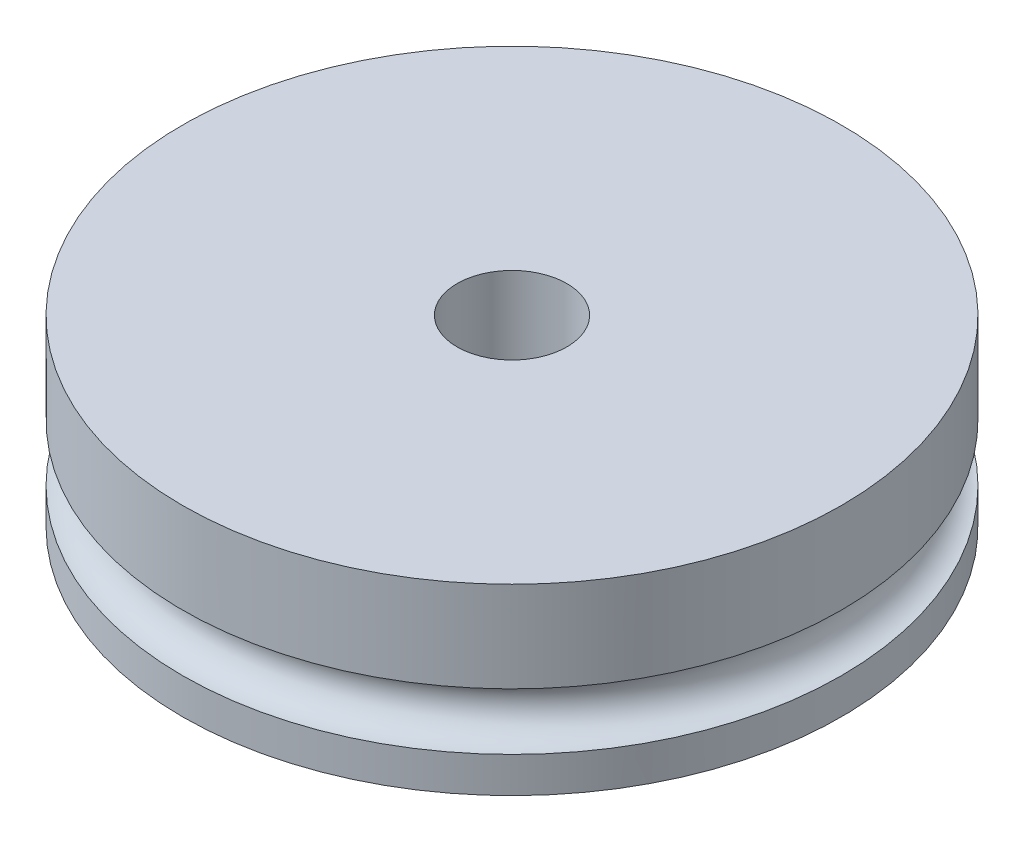
ISO-10303-21;
HEADER;
FILE_DESCRIPTION(('STEP AP214'),'2;1');
FILE_NAME('part.step','',(''),(''),'','','');
FILE_SCHEMA(('AUTOMOTIVE_DESIGN { 1 0 10303 214 1 1 1 1 }'));
ENDSEC;
DATA;
#1=APPLICATION_CONTEXT('core data for automotive mechanical design processes');
#2=APPLICATION_PROTOCOL_DEFINITION('international standard','automotive_design',2000,#1);
#3=PRODUCT_CONTEXT('',#1,'mechanical');
#4=PRODUCT('Part','Part','',(#3));
#5=PRODUCT_RELATED_PRODUCT_CATEGORY('part','',(#4));
#6=PRODUCT_DEFINITION_FORMATION('','',#4);
#7=PRODUCT_DEFINITION_CONTEXT('part definition',#1,'design');
#8=PRODUCT_DEFINITION('design','',#6,#7);
#9=PRODUCT_DEFINITION_SHAPE('','',#8);
#10=(LENGTH_UNIT() NAMED_UNIT(*) SI_UNIT(.MILLI.,.METRE.));
#11=(NAMED_UNIT(*) PLANE_ANGLE_UNIT() SI_UNIT($,.RADIAN.));
#12=(NAMED_UNIT(*) SI_UNIT($,.STERADIAN.) SOLID_ANGLE_UNIT());
#13=UNCERTAINTY_MEASURE_WITH_UNIT(LENGTH_MEASURE(1.E-05),#10,'distance_accuracy_value','');
#14=(GEOMETRIC_REPRESENTATION_CONTEXT(3) GLOBAL_UNCERTAINTY_ASSIGNED_CONTEXT((#13)) GLOBAL_UNIT_ASSIGNED_CONTEXT((#10,
#11,#12)) REPRESENTATION_CONTEXT('',''));
#15=CARTESIAN_POINT('',(0.,0.,0.));
#16=DIRECTION('',(0.,0.,1.));
#17=DIRECTION('',(1.,0.,0.));
#18=AXIS2_PLACEMENT_3D('',#15,#16,#17);
#19=CARTESIAN_POINT('',(0.,10.,0.));
#20=DIRECTION('',(0.,-1.,0.));
#21=DIRECTION('',(0.,0.,-1.));
#22=AXIS2_PLACEMENT_3D('',#19,#20,#21);
#23=CYLINDRICAL_SURFACE('',#22,18.);
#24=CARTESIAN_POINT('',(0.,1.95000000000001,0.));
#25=DIRECTION('',(0.,1.,0.));
#26=DIRECTION('',(-1.,0.,0.));
#27=AXIS2_PLACEMENT_3D('',#24,#25,#26);
#28=CIRCLE('',#27,18.);
#29=CARTESIAN_POINT('',(-18.,1.95000000000001,0.));
#30=VERTEX_POINT('',#29);
#31=EDGE_CURVE('E35',#30,#30,#28,.F.);
#32=ORIENTED_EDGE('',*,*,#31,.T.);
#33=EDGE_LOOP('',(#32));
#34=FACE_BOUND('',#33,.T.);
#35=CARTESIAN_POINT('',(0.,0.,0.));
#36=DIRECTION('',(0.,1.,0.));
#37=DIRECTION('',(0.,0.,1.));
#38=AXIS2_PLACEMENT_3D('',#35,#36,#37);
#39=CIRCLE('',#38,18.);
#40=CARTESIAN_POINT('',(0.,0.,18.));
#41=VERTEX_POINT('',#40);
#42=EDGE_CURVE('E39',#41,#41,#39,.T.);
#43=ORIENTED_EDGE('',*,*,#42,.T.);
#44=EDGE_LOOP('',(#43));
#45=FACE_BOUND('',#44,.T.);
#46=ADVANCED_FACE('F31',(#34,#45),#23,.T.);
#47=CARTESIAN_POINT('',(0.,0.,0.));
#48=DIRECTION('',(0.,1.,0.));
#49=DIRECTION('',(0.,0.,1.));
#50=AXIS2_PLACEMENT_3D('',#47,#48,#49);
#51=PLANE('',#50);
#52=ORIENTED_EDGE('',*,*,#42,.F.);
#53=EDGE_LOOP('',(#52));
#54=FACE_BOUND('',#53,.T.);
#55=ADVANCED_FACE('F70',(#54),#51,.F.);
#56=CARTESIAN_POINT('',(0.,3.5,0.));
#57=DIRECTION('',(0.,-1.,0.));
#58=DIRECTION('',(1.,0.,0.));
#59=AXIS2_PLACEMENT_3D('',#56,#57,#58);
#60=TOROIDAL_SURFACE('',#59,18.,1.55);
#61=CARTESIAN_POINT('',(0.,5.05,0.));
#62=DIRECTION('',(0.,-1.,0.));
#63=DIRECTION('',(1.,0.,0.));
#64=AXIS2_PLACEMENT_3D('',#61,#62,#63);
#65=CIRCLE('',#64,18.);
#66=CARTESIAN_POINT('',(18.,5.05,0.));
#67=VERTEX_POINT('',#66);
#68=EDGE_CURVE('E48',#67,#67,#65,.F.);
#69=ORIENTED_EDGE('',*,*,#68,.F.);
#70=EDGE_LOOP('',(#69));
#71=FACE_BOUND('',#70,.T.);
#72=ORIENTED_EDGE('',*,*,#31,.F.);
#73=EDGE_LOOP('',(#72));
#74=FACE_BOUND('',#73,.T.);
#75=ADVANCED_FACE('F64',(#71,#74),#60,.F.);
#76=CARTESIAN_POINT('',(0.,10.,0.));
#77=DIRECTION('',(0.,1.,0.));
#78=DIRECTION('',(0.,0.,1.));
#79=AXIS2_PLACEMENT_3D('',#76,#77,#78);
#80=PLANE('',#79);
#81=CARTESIAN_POINT('',(0.,10.,0.));
#82=DIRECTION('',(0.,1.,0.));
#83=DIRECTION('',(0.,0.,1.));
#84=AXIS2_PLACEMENT_3D('',#81,#82,#83);
#85=CIRCLE('',#84,3.);
#86=CARTESIAN_POINT('',(0.,10.,3.));
#87=VERTEX_POINT('',#86);
#88=EDGE_CURVE('E46',#87,#87,#85,.T.);
#89=ORIENTED_EDGE('',*,*,#88,.F.);
#90=EDGE_LOOP('',(#89));
#91=FACE_BOUND('',#90,.T.);
#92=CARTESIAN_POINT('',(0.,10.,0.));
#93=DIRECTION('',(0.,1.,0.));
#94=DIRECTION('',(0.,0.,1.));
#95=AXIS2_PLACEMENT_3D('',#92,#93,#94);
#96=CIRCLE('',#95,18.);
#97=CARTESIAN_POINT('',(0.,10.,18.));
#98=VERTEX_POINT('',#97);
#99=EDGE_CURVE('E10',#98,#98,#96,.T.);
#100=ORIENTED_EDGE('',*,*,#99,.T.);
#101=EDGE_LOOP('',(#100));
#102=FACE_BOUND('',#101,.T.);
#103=ADVANCED_FACE('F62',(#91,#102),#80,.T.);
#104=ORIENTED_EDGE('',*,*,#68,.T.);
#105=EDGE_LOOP('',(#104));
#106=FACE_BOUND('',#105,.T.);
#107=ORIENTED_EDGE('',*,*,#99,.F.);
#108=EDGE_LOOP('',(#107));
#109=FACE_BOUND('',#108,.T.);
#110=ADVANCED_FACE('F33',(#106,#109),#23,.T.);
#111=CARTESIAN_POINT('',(0.,2.,0.));
#112=DIRECTION('',(0.,1.,0.));
#113=DIRECTION('',(0.,0.,1.));
#114=AXIS2_PLACEMENT_3D('',#111,#112,#113);
#115=CYLINDRICAL_SURFACE('',#114,3.);
#116=CARTESIAN_POINT('',(0.,2.,0.));
#117=DIRECTION('',(0.,1.,0.));
#118=DIRECTION('',(0.,0.,1.));
#119=AXIS2_PLACEMENT_3D('',#116,#117,#118);
#120=CIRCLE('',#119,3.);
#121=CARTESIAN_POINT('',(0.,2.,3.));
#122=VERTEX_POINT('',#121);
#123=EDGE_CURVE('E50',#122,#122,#120,.T.);
#124=ORIENTED_EDGE('',*,*,#123,.F.);
#125=EDGE_LOOP('',(#124));
#126=FACE_BOUND('',#125,.T.);
#127=ORIENTED_EDGE('',*,*,#88,.T.);
#128=EDGE_LOOP('',(#127));
#129=FACE_BOUND('',#128,.T.);
#130=ADVANCED_FACE('F60',(#126,#129),#115,.F.);
#131=CARTESIAN_POINT('',(0.,2.,0.));
#132=DIRECTION('',(0.,1.,0.));
#133=DIRECTION('',(0.,0.,1.));
#134=AXIS2_PLACEMENT_3D('',#131,#132,#133);
#135=PLANE('',#134);
#136=ORIENTED_EDGE('',*,*,#123,.T.);
#137=EDGE_LOOP('',(#136));
#138=FACE_BOUND('',#137,.T.);
#139=ADVANCED_FACE('F110',(#138),#135,.T.);
#140=CLOSED_SHELL('',(#46,#55,#75,#103,#110,#130,#139));
#141=MANIFOLD_SOLID_BREP('B2',#140);
#142=ADVANCED_BREP_SHAPE_REPRESENTATION('',(#18,#141),#14);
#143=SHAPE_DEFINITION_REPRESENTATION(#9,#142);
ENDSEC;
END-ISO-10303-21;
